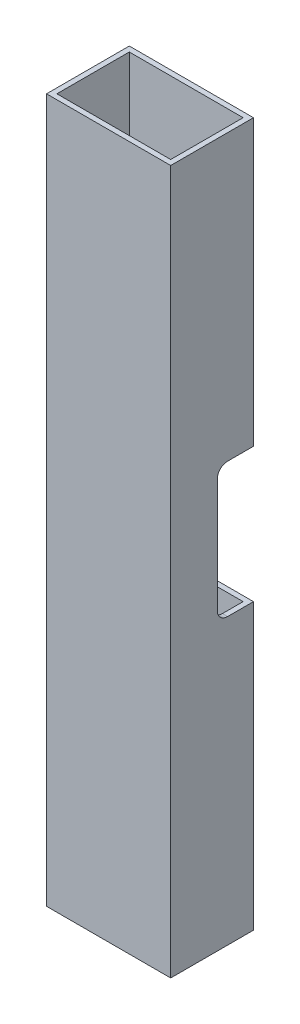
ISO-10303-21;
HEADER;
FILE_DESCRIPTION(('STEP AP214'),'2;1');
FILE_NAME('part.step','',(''),(''),'','','');
FILE_SCHEMA(('AUTOMOTIVE_DESIGN { 1 0 10303 214 1 1 1 1 }'));
ENDSEC;
DATA;
#1=APPLICATION_CONTEXT('core data for automotive mechanical design processes');
#2=APPLICATION_PROTOCOL_DEFINITION('international standard','automotive_design',2000,#1);
#3=PRODUCT_CONTEXT('',#1,'mechanical');
#4=PRODUCT('Part','Part','',(#3));
#5=PRODUCT_RELATED_PRODUCT_CATEGORY('part','',(#4));
#6=PRODUCT_DEFINITION_FORMATION('','',#4);
#7=PRODUCT_DEFINITION_CONTEXT('part definition',#1,'design');
#8=PRODUCT_DEFINITION('design','',#6,#7);
#9=PRODUCT_DEFINITION_SHAPE('','',#8);
#10=(LENGTH_UNIT() NAMED_UNIT(*) SI_UNIT(.MILLI.,.METRE.));
#11=(NAMED_UNIT(*) PLANE_ANGLE_UNIT() SI_UNIT($,.RADIAN.));
#12=(NAMED_UNIT(*) SI_UNIT($,.STERADIAN.) SOLID_ANGLE_UNIT());
#13=UNCERTAINTY_MEASURE_WITH_UNIT(LENGTH_MEASURE(1.E-05),#10,'distance_accuracy_value','');
#14=(GEOMETRIC_REPRESENTATION_CONTEXT(3) GLOBAL_UNCERTAINTY_ASSIGNED_CONTEXT((#13)) GLOBAL_UNIT_ASSIGNED_CONTEXT((#10,
#11,#12)) REPRESENTATION_CONTEXT('',''));
#15=CARTESIAN_POINT('',(0.,0.,0.));
#16=DIRECTION('',(0.,0.,1.));
#17=DIRECTION('',(1.,0.,0.));
#18=AXIS2_PLACEMENT_3D('',#15,#16,#17);
#19=CARTESIAN_POINT('',(0.,-215.9,-25.4));
#20=DIRECTION('',(0.,0.,-1.));
#21=DIRECTION('',(-1.,0.,0.));
#22=AXIS2_PLACEMENT_3D('',#19,#20,#21);
#23=PLANE('',#22);
#24=DIRECTION('',(0.,1.,0.));
#25=VECTOR('',#24,1.);
#26=CARTESIAN_POINT('',(38.1,-215.9,-25.4));
#27=LINE('',#26,#25);
#28=CARTESIAN_POINT('',(38.1,41.275,-25.4));
#29=VERTEX_POINT('',#28);
#30=CARTESIAN_POINT('',(38.1,215.9,-25.4));
#31=VERTEX_POINT('',#30);
#32=EDGE_CURVE('E213',#29,#31,#27,.T.);
#33=ORIENTED_EDGE('',*,*,#32,.F.);
#34=DIRECTION('',(-1.,0.,0.));
#35=VECTOR('',#34,1.);
#36=CARTESIAN_POINT('',(1971.59584113364,41.275,-25.3999999999995));
#37=LINE('',#36,#35);
#38=CARTESIAN_POINT('',(-38.1,41.275,-25.4));
#39=VERTEX_POINT('',#38);
#40=EDGE_CURVE('E200',#29,#39,#37,.T.);
#41=ORIENTED_EDGE('',*,*,#40,.T.);
#42=DIRECTION('',(0.,1.,0.));
#43=VECTOR('',#42,1.);
#44=CARTESIAN_POINT('',(-38.1,-215.9,-25.4));
#45=LINE('',#44,#43);
#46=CARTESIAN_POINT('',(-38.1,215.9,-25.4));
#47=VERTEX_POINT('',#46);
#48=EDGE_CURVE('E211',#39,#47,#45,.T.);
#49=ORIENTED_EDGE('',*,*,#48,.T.);
#50=DIRECTION('',(-1.,0.,0.));
#51=VECTOR('',#50,1.);
#52=CARTESIAN_POINT('',(0.,215.9,-25.4));
#53=LINE('',#52,#51);
#54=EDGE_CURVE('E325',#31,#47,#53,.T.);
#55=ORIENTED_EDGE('',*,*,#54,.F.);
#56=EDGE_LOOP('',(#33,#41,#49,#55));
#57=FACE_BOUND('',#56,.T.);
#58=ADVANCED_FACE('F14',(#57),#23,.T.);
#59=CARTESIAN_POINT('',(34.925,-215.9,0.));
#60=DIRECTION('',(1.,0.,0.));
#61=DIRECTION('',(0.,0.,-1.));
#62=AXIS2_PLACEMENT_3D('',#59,#60,#61);
#63=PLANE('',#62);
#64=DIRECTION('',(0.,0.,-1.));
#65=VECTOR('',#64,1.);
#66=CARTESIAN_POINT('',(34.925,41.275,-1.29116165991135E-13));
#67=LINE('',#66,#65);
#68=CARTESIAN_POINT('',(34.925,41.275,-9.525));
#69=VERTEX_POINT('',#68);
#70=CARTESIAN_POINT('',(34.925,41.275,-22.225));
#71=VERTEX_POINT('',#70);
#72=EDGE_CURVE('E398',#69,#71,#67,.T.);
#73=ORIENTED_EDGE('',*,*,#72,.F.);
#74=CARTESIAN_POINT('',(34.925,34.925,-9.525));
#75=DIRECTION('',(1.,0.,0.));
#76=DIRECTION('',(0.,0.,-1.));
#77=AXIS2_PLACEMENT_3D('',#74,#75,#76);
#78=CIRCLE('',#77,6.35);
#79=CARTESIAN_POINT('',(34.925,34.925,-3.175));
#80=VERTEX_POINT('',#79);
#81=EDGE_CURVE('E424',#69,#80,#78,.T.);
#82=ORIENTED_EDGE('',*,*,#81,.T.);
#83=DIRECTION('',(0.,-1.,0.));
#84=VECTOR('',#83,1.);
#85=CARTESIAN_POINT('',(34.925,-215.9,-3.17499999999996));
#86=LINE('',#85,#84);
#87=CARTESIAN_POINT('',(34.925,-34.925,-3.175));
#88=VERTEX_POINT('',#87);
#89=EDGE_CURVE('E417',#80,#88,#86,.T.);
#90=ORIENTED_EDGE('',*,*,#89,.T.);
#91=CARTESIAN_POINT('',(34.925,-34.925,-9.525));
#92=DIRECTION('',(1.,0.,0.));
#93=DIRECTION('',(0.,0.,-1.));
#94=AXIS2_PLACEMENT_3D('',#91,#92,#93);
#95=CIRCLE('',#94,6.35);
#96=CARTESIAN_POINT('',(34.925,-41.275,-9.525));
#97=VERTEX_POINT('',#96);
#98=EDGE_CURVE('E277',#88,#97,#95,.T.);
#99=ORIENTED_EDGE('',*,*,#98,.T.);
#100=DIRECTION('',(0.,0.,-1.));
#101=VECTOR('',#100,1.);
#102=CARTESIAN_POINT('',(34.925,-41.275,0.));
#103=LINE('',#102,#101);
#104=CARTESIAN_POINT('',(34.925,-41.275,-22.225));
#105=VERTEX_POINT('',#104);
#106=EDGE_CURVE('E276',#97,#105,#103,.T.);
#107=ORIENTED_EDGE('',*,*,#106,.T.);
#108=DIRECTION('',(0.,1.,0.));
#109=VECTOR('',#108,1.);
#110=CARTESIAN_POINT('',(34.925,-215.9,-22.225));
#111=LINE('',#110,#109);
#112=CARTESIAN_POINT('',(34.925,-215.9,-22.225));
#113=VERTEX_POINT('',#112);
#114=EDGE_CURVE('E274',#113,#105,#111,.T.);
#115=ORIENTED_EDGE('',*,*,#114,.F.);
#116=DIRECTION('',(0.,0.,-1.));
#117=VECTOR('',#116,1.);
#118=CARTESIAN_POINT('',(34.925,-215.9,0.));
#119=LINE('',#118,#117);
#120=CARTESIAN_POINT('',(34.925,-215.9,22.225));
#121=VERTEX_POINT('',#120);
#122=EDGE_CURVE('E307',#121,#113,#119,.T.);
#123=ORIENTED_EDGE('',*,*,#122,.F.);
#124=DIRECTION('',(0.,1.,0.));
#125=VECTOR('',#124,1.);
#126=CARTESIAN_POINT('',(34.925,-215.9,22.225));
#127=LINE('',#126,#125);
#128=CARTESIAN_POINT('',(34.925,215.9,22.225));
#129=VERTEX_POINT('',#128);
#130=EDGE_CURVE('E246',#121,#129,#127,.T.);
#131=ORIENTED_EDGE('',*,*,#130,.T.);
#132=DIRECTION('',(0.,0.,-1.));
#133=VECTOR('',#132,1.);
#134=CARTESIAN_POINT('',(34.925,215.9,0.));
#135=LINE('',#134,#133);
#136=CARTESIAN_POINT('',(34.925,215.9,-22.225));
#137=VERTEX_POINT('',#136);
#138=EDGE_CURVE('E305',#129,#137,#135,.T.);
#139=ORIENTED_EDGE('',*,*,#138,.T.);
#140=EDGE_CURVE('E284',#71,#137,#111,.T.);
#141=ORIENTED_EDGE('',*,*,#140,.F.);
#142=EDGE_LOOP('',(#73,#82,#90,#99,#107,#115,#123,#131,#139,#141));
#143=FACE_BOUND('',#142,.T.);
#144=ADVANCED_FACE('F303',(#143),#63,.F.);
#145=CARTESIAN_POINT('',(0.,-215.9,-22.225));
#146=DIRECTION('',(0.,0.,-1.));
#147=DIRECTION('',(-1.,0.,0.));
#148=AXIS2_PLACEMENT_3D('',#145,#146,#147);
#149=PLANE('',#148);
#150=DIRECTION('',(-1.,0.,0.));
#151=VECTOR('',#150,1.);
#152=CARTESIAN_POINT('',(0.,41.275,-22.225));
#153=LINE('',#152,#151);
#154=CARTESIAN_POINT('',(-34.925,41.275,-22.225));
#155=VERTEX_POINT('',#154);
#156=EDGE_CURVE('E395',#71,#155,#153,.T.);
#157=ORIENTED_EDGE('',*,*,#156,.F.);
#158=ORIENTED_EDGE('',*,*,#140,.T.);
#159=DIRECTION('',(-1.,0.,0.));
#160=VECTOR('',#159,1.);
#161=CARTESIAN_POINT('',(0.,215.9,-22.225));
#162=LINE('',#161,#160);
#163=CARTESIAN_POINT('',(-34.925,215.9,-22.225));
#164=VERTEX_POINT('',#163);
#165=EDGE_CURVE('E320',#137,#164,#162,.T.);
#166=ORIENTED_EDGE('',*,*,#165,.T.);
#167=DIRECTION('',(0.,1.,0.));
#168=VECTOR('',#167,1.);
#169=CARTESIAN_POINT('',(-34.925,-215.9,-22.225));
#170=LINE('',#169,#168);
#171=EDGE_CURVE('E285',#155,#164,#170,.T.);
#172=ORIENTED_EDGE('',*,*,#171,.F.);
#173=EDGE_LOOP('',(#157,#158,#166,#172));
#174=FACE_BOUND('',#173,.T.);
#175=ADVANCED_FACE('F482',(#174),#149,.F.);
#176=CARTESIAN_POINT('',(38.1,-215.9,0.));
#177=DIRECTION('',(1.,0.,0.));
#178=DIRECTION('',(0.,0.,-1.));
#179=AXIS2_PLACEMENT_3D('',#176,#177,#178);
#180=PLANE('',#179);
#181=CARTESIAN_POINT('',(38.1,34.925,-9.525));
#182=DIRECTION('',(1.,0.,0.));
#183=DIRECTION('',(0.,0.,-1.));
#184=AXIS2_PLACEMENT_3D('',#181,#182,#183);
#185=CIRCLE('',#184,6.35);
#186=CARTESIAN_POINT('',(38.1,41.275,-9.525));
#187=VERTEX_POINT('',#186);
#188=CARTESIAN_POINT('',(38.1,34.925,-3.175));
#189=VERTEX_POINT('',#188);
#190=EDGE_CURVE('E215',#187,#189,#185,.T.);
#191=ORIENTED_EDGE('',*,*,#190,.F.);
#192=DIRECTION('',(0.,0.,-1.));
#193=VECTOR('',#192,1.);
#194=CARTESIAN_POINT('',(38.1,41.275,-1.29116165991135E-13));
#195=LINE('',#194,#193);
#196=EDGE_CURVE('E354',#187,#29,#195,.T.);
#197=ORIENTED_EDGE('',*,*,#196,.T.);
#198=ORIENTED_EDGE('',*,*,#32,.T.);
#199=DIRECTION('',(0.,0.,-1.));
#200=VECTOR('',#199,1.);
#201=CARTESIAN_POINT('',(38.1,215.9,0.));
#202=LINE('',#201,#200);
#203=CARTESIAN_POINT('',(38.1,215.9,25.4));
#204=VERTEX_POINT('',#203);
#205=EDGE_CURVE('E370',#204,#31,#202,.T.);
#206=ORIENTED_EDGE('',*,*,#205,.F.);
#207=DIRECTION('',(0.,1.,0.));
#208=VECTOR('',#207,1.);
#209=CARTESIAN_POINT('',(38.1,-215.9,25.4));
#210=LINE('',#209,#208);
#211=CARTESIAN_POINT('',(38.1,-215.9,25.4));
#212=VERTEX_POINT('',#211);
#213=EDGE_CURVE('E238',#212,#204,#210,.T.);
#214=ORIENTED_EDGE('',*,*,#213,.F.);
#215=DIRECTION('',(0.,0.,-1.));
#216=VECTOR('',#215,1.);
#217=CARTESIAN_POINT('',(38.1,-215.9,0.));
#218=LINE('',#217,#216);
#219=CARTESIAN_POINT('',(38.1,-215.9,-25.4));
#220=VERTEX_POINT('',#219);
#221=EDGE_CURVE('E337',#212,#220,#218,.T.);
#222=ORIENTED_EDGE('',*,*,#221,.T.);
#223=CARTESIAN_POINT('',(38.1,-41.275,-25.4));
#224=VERTEX_POINT('',#223);
#225=EDGE_CURVE('E225',#220,#224,#27,.T.);
#226=ORIENTED_EDGE('',*,*,#225,.T.);
#227=DIRECTION('',(0.,0.,-1.));
#228=VECTOR('',#227,1.);
#229=CARTESIAN_POINT('',(38.1,-41.275,0.));
#230=LINE('',#229,#228);
#231=CARTESIAN_POINT('',(38.1,-41.275,-9.525));
#232=VERTEX_POINT('',#231);
#233=EDGE_CURVE('E399',#232,#224,#230,.T.);
#234=ORIENTED_EDGE('',*,*,#233,.F.);
#235=CARTESIAN_POINT('',(38.1,-34.925,-9.525));
#236=DIRECTION('',(1.,0.,0.));
#237=DIRECTION('',(0.,0.,-1.));
#238=AXIS2_PLACEMENT_3D('',#235,#236,#237);
#239=CIRCLE('',#238,6.35);
#240=CARTESIAN_POINT('',(38.1,-34.925,-3.175));
#241=VERTEX_POINT('',#240);
#242=EDGE_CURVE('E414',#241,#232,#239,.T.);
#243=ORIENTED_EDGE('',*,*,#242,.F.);
#244=DIRECTION('',(0.,-1.,0.));
#245=VECTOR('',#244,1.);
#246=CARTESIAN_POINT('',(38.1,-215.9,-3.17499999999995));
#247=LINE('',#246,#245);
#248=EDGE_CURVE('E421',#189,#241,#247,.T.);
#249=ORIENTED_EDGE('',*,*,#248,.F.);
#250=EDGE_LOOP('',(#191,#197,#198,#206,#214,#222,#226,#234,#243,#249));
#251=FACE_BOUND('',#250,.T.);
#252=ADVANCED_FACE('F16',(#251),#180,.T.);
#253=CARTESIAN_POINT('',(-34.925,-215.9,0.));
#254=DIRECTION('',(1.,0.,0.));
#255=DIRECTION('',(0.,0.,-1.));
#256=AXIS2_PLACEMENT_3D('',#253,#254,#255);
#257=PLANE('',#256);
#258=CARTESIAN_POINT('',(-34.925,34.925,-9.525));
#259=DIRECTION('',(1.,0.,0.));
#260=DIRECTION('',(0.,0.,-1.));
#261=AXIS2_PLACEMENT_3D('',#258,#259,#260);
#262=CIRCLE('',#261,6.35);
#263=CARTESIAN_POINT('',(-34.925,41.275,-9.52499999999974));
#264=VERTEX_POINT('',#263);
#265=CARTESIAN_POINT('',(-34.925,34.925,-3.175));
#266=VERTEX_POINT('',#265);
#267=EDGE_CURVE('E242',#264,#266,#262,.T.);
#268=ORIENTED_EDGE('',*,*,#267,.F.);
#269=DIRECTION('',(0.,0.,-1.));
#270=VECTOR('',#269,1.);
#271=CARTESIAN_POINT('',(-34.925,41.275,-1.29116165991135E-13));
#272=LINE('',#271,#270);
#273=EDGE_CURVE('E9',#264,#155,#272,.T.);
#274=ORIENTED_EDGE('',*,*,#273,.T.);
#275=ORIENTED_EDGE('',*,*,#171,.T.);
#276=DIRECTION('',(0.,0.,-1.));
#277=VECTOR('',#276,1.);
#278=CARTESIAN_POINT('',(-34.925,215.9,0.));
#279=LINE('',#278,#277);
#280=CARTESIAN_POINT('',(-34.925,215.9,22.225));
#281=VERTEX_POINT('',#280);
#282=EDGE_CURVE('E335',#281,#164,#279,.T.);
#283=ORIENTED_EDGE('',*,*,#282,.F.);
#284=DIRECTION('',(0.,1.,0.));
#285=VECTOR('',#284,1.);
#286=CARTESIAN_POINT('',(-34.925,-215.9,22.225));
#287=LINE('',#286,#285);
#288=CARTESIAN_POINT('',(-34.925,-215.9,22.225));
#289=VERTEX_POINT('',#288);
#290=EDGE_CURVE('E241',#289,#281,#287,.T.);
#291=ORIENTED_EDGE('',*,*,#290,.F.);
#292=DIRECTION('',(0.,0.,-1.));
#293=VECTOR('',#292,1.);
#294=CARTESIAN_POINT('',(-34.925,-215.9,0.));
#295=LINE('',#294,#293);
#296=CARTESIAN_POINT('',(-34.925,-215.9,-22.225));
#297=VERTEX_POINT('',#296);
#298=EDGE_CURVE('E282',#289,#297,#295,.T.);
#299=ORIENTED_EDGE('',*,*,#298,.T.);
#300=CARTESIAN_POINT('',(-34.925,-41.275,-22.225));
#301=VERTEX_POINT('',#300);
#302=EDGE_CURVE('E271',#297,#301,#170,.T.);
#303=ORIENTED_EDGE('',*,*,#302,.T.);
#304=DIRECTION('',(0.,0.,-1.));
#305=VECTOR('',#304,1.);
#306=CARTESIAN_POINT('',(-34.925,-41.275,0.));
#307=LINE('',#306,#305);
#308=CARTESIAN_POINT('',(-34.925,-41.275,-9.525));
#309=VERTEX_POINT('',#308);
#310=EDGE_CURVE('E23',#309,#301,#307,.T.);
#311=ORIENTED_EDGE('',*,*,#310,.F.);
#312=CARTESIAN_POINT('',(-34.925,-34.925,-9.525));
#313=DIRECTION('',(1.,0.,0.));
#314=DIRECTION('',(0.,0.,-1.));
#315=AXIS2_PLACEMENT_3D('',#312,#313,#314);
#316=CIRCLE('',#315,6.35);
#317=CARTESIAN_POINT('',(-34.925,-34.925,-3.175));
#318=VERTEX_POINT('',#317);
#319=EDGE_CURVE('E249',#318,#309,#316,.T.);
#320=ORIENTED_EDGE('',*,*,#319,.F.);
#321=DIRECTION('',(0.,-1.,0.));
#322=VECTOR('',#321,1.);
#323=CARTESIAN_POINT('',(-34.925,-215.9,-3.175));
#324=LINE('',#323,#322);
#325=EDGE_CURVE('E245',#266,#318,#324,.T.);
#326=ORIENTED_EDGE('',*,*,#325,.F.);
#327=EDGE_LOOP('',(#268,#274,#275,#283,#291,#299,#303,#311,#320,#326));
#328=FACE_BOUND('',#327,.T.);
#329=ADVANCED_FACE('F280',(#328),#257,.T.);
#330=CARTESIAN_POINT('',(0.,-215.9,22.225));
#331=DIRECTION('',(0.,0.,-1.));
#332=DIRECTION('',(-1.,0.,0.));
#333=AXIS2_PLACEMENT_3D('',#330,#331,#332);
#334=PLANE('',#333);
#335=DIRECTION('',(-1.,0.,0.));
#336=VECTOR('',#335,1.);
#337=CARTESIAN_POINT('',(0.,215.9,22.225));
#338=LINE('',#337,#336);
#339=EDGE_CURVE('E317',#129,#281,#338,.T.);
#340=ORIENTED_EDGE('',*,*,#339,.F.);
#341=ORIENTED_EDGE('',*,*,#130,.F.);
#342=DIRECTION('',(-1.,0.,0.));
#343=VECTOR('',#342,1.);
#344=CARTESIAN_POINT('',(0.,-215.9,22.225));
#345=LINE('',#344,#343);
#346=EDGE_CURVE('E363',#121,#289,#345,.T.);
#347=ORIENTED_EDGE('',*,*,#346,.T.);
#348=ORIENTED_EDGE('',*,*,#290,.T.);
#349=EDGE_LOOP('',(#340,#341,#347,#348));
#350=FACE_BOUND('',#349,.T.);
#351=ADVANCED_FACE('F323',(#350),#334,.T.);
#352=ORIENTED_EDGE('',*,*,#114,.T.);
#353=DIRECTION('',(-1.,0.,0.));
#354=VECTOR('',#353,1.);
#355=CARTESIAN_POINT('',(0.,-41.275,-22.225));
#356=LINE('',#355,#354);
#357=EDGE_CURVE('E260',#105,#301,#356,.T.);
#358=ORIENTED_EDGE('',*,*,#357,.T.);
#359=ORIENTED_EDGE('',*,*,#302,.F.);
#360=DIRECTION('',(-1.,0.,0.));
#361=VECTOR('',#360,1.);
#362=CARTESIAN_POINT('',(0.,-215.9,-22.225));
#363=LINE('',#362,#361);
#364=EDGE_CURVE('E366',#113,#297,#363,.T.);
#365=ORIENTED_EDGE('',*,*,#364,.F.);
#366=EDGE_LOOP('',(#352,#358,#359,#365));
#367=FACE_BOUND('',#366,.T.);
#368=ADVANCED_FACE('F270',(#367),#149,.F.);
#369=CARTESIAN_POINT('',(0.,-215.9,25.4));
#370=DIRECTION('',(0.,0.,-1.));
#371=DIRECTION('',(-1.,0.,0.));
#372=AXIS2_PLACEMENT_3D('',#369,#370,#371);
#373=PLANE('',#372);
#374=DIRECTION('',(-1.,0.,0.));
#375=VECTOR('',#374,1.);
#376=CARTESIAN_POINT('',(0.,215.9,25.4));
#377=LINE('',#376,#375);
#378=CARTESIAN_POINT('',(-38.1,215.9,25.4));
#379=VERTEX_POINT('',#378);
#380=EDGE_CURVE('E373',#204,#379,#377,.T.);
#381=ORIENTED_EDGE('',*,*,#380,.T.);
#382=DIRECTION('',(0.,1.,0.));
#383=VECTOR('',#382,1.);
#384=CARTESIAN_POINT('',(-38.1,-215.9,25.4));
#385=LINE('',#384,#383);
#386=CARTESIAN_POINT('',(-38.1,-215.9,25.4));
#387=VERTEX_POINT('',#386);
#388=EDGE_CURVE('E231',#387,#379,#385,.T.);
#389=ORIENTED_EDGE('',*,*,#388,.F.);
#390=DIRECTION('',(-1.,0.,0.));
#391=VECTOR('',#390,1.);
#392=CARTESIAN_POINT('',(0.,-215.9,25.4));
#393=LINE('',#392,#391);
#394=EDGE_CURVE('E342',#212,#387,#393,.T.);
#395=ORIENTED_EDGE('',*,*,#394,.F.);
#396=ORIENTED_EDGE('',*,*,#213,.T.);
#397=EDGE_LOOP('',(#381,#389,#395,#396));
#398=FACE_BOUND('',#397,.T.);
#399=ADVANCED_FACE('F385',(#398),#373,.F.);
#400=CARTESIAN_POINT('',(-38.1,-215.9,0.));
#401=DIRECTION('',(1.,0.,0.));
#402=DIRECTION('',(0.,0.,-1.));
#403=AXIS2_PLACEMENT_3D('',#400,#401,#402);
#404=PLANE('',#403);
#405=ORIENTED_EDGE('',*,*,#48,.F.);
#406=DIRECTION('',(0.,0.,1.));
#407=VECTOR('',#406,1.);
#408=CARTESIAN_POINT('',(-38.1,41.275,-16.5904098328203));
#409=LINE('',#408,#407);
#410=CARTESIAN_POINT('',(-38.1,41.275,-9.525));
#411=VERTEX_POINT('',#410);
#412=EDGE_CURVE('E196',#39,#411,#409,.T.);
#413=ORIENTED_EDGE('',*,*,#412,.T.);
#414=CARTESIAN_POINT('',(-38.1,34.925,-9.525));
#415=DIRECTION('',(-1.,0.,0.));
#416=DIRECTION('',(0.,0.,1.));
#417=AXIS2_PLACEMENT_3D('',#414,#415,#416);
#418=CIRCLE('',#417,6.35);
#419=CARTESIAN_POINT('',(-38.1,34.925,-3.175));
#420=VERTEX_POINT('',#419);
#421=EDGE_CURVE('E445',#420,#411,#418,.T.);
#422=ORIENTED_EDGE('',*,*,#421,.F.);
#423=DIRECTION('',(0.,1.,0.));
#424=VECTOR('',#423,1.);
#425=CARTESIAN_POINT('',(-38.1,-0.325113534927367,-3.175));
#426=LINE('',#425,#424);
#427=CARTESIAN_POINT('',(-38.1,-34.925,-3.175));
#428=VERTEX_POINT('',#427);
#429=EDGE_CURVE('E35',#428,#420,#426,.T.);
#430=ORIENTED_EDGE('',*,*,#429,.F.);
#431=CARTESIAN_POINT('',(-38.1,-34.925,-9.525));
#432=DIRECTION('',(-1.,0.,0.));
#433=DIRECTION('',(0.,-1.,0.));
#434=AXIS2_PLACEMENT_3D('',#431,#432,#433);
#435=CIRCLE('',#434,6.35);
#436=CARTESIAN_POINT('',(-38.1,-41.275,-9.525));
#437=VERTEX_POINT('',#436);
#438=EDGE_CURVE('E450',#437,#428,#435,.T.);
#439=ORIENTED_EDGE('',*,*,#438,.F.);
#440=DIRECTION('',(0.,0.,1.));
#441=VECTOR('',#440,1.);
#442=CARTESIAN_POINT('',(-38.1,-41.275,-16.5904098328203));
#443=LINE('',#442,#441);
#444=CARTESIAN_POINT('',(-38.1,-41.275,-25.4));
#445=VERTEX_POINT('',#444);
#446=EDGE_CURVE('E206',#445,#437,#443,.T.);
#447=ORIENTED_EDGE('',*,*,#446,.F.);
#448=CARTESIAN_POINT('',(-38.1,-215.9,-25.4));
#449=VERTEX_POINT('',#448);
#450=EDGE_CURVE('E224',#449,#445,#45,.T.);
#451=ORIENTED_EDGE('',*,*,#450,.F.);
#452=DIRECTION('',(0.,0.,-1.));
#453=VECTOR('',#452,1.);
#454=CARTESIAN_POINT('',(-38.1,-215.9,0.));
#455=LINE('',#454,#453);
#456=EDGE_CURVE('E351',#387,#449,#455,.T.);
#457=ORIENTED_EDGE('',*,*,#456,.F.);
#458=ORIENTED_EDGE('',*,*,#388,.T.);
#459=DIRECTION('',(0.,0.,-1.));
#460=VECTOR('',#459,1.);
#461=CARTESIAN_POINT('',(-38.1,215.9,0.));
#462=LINE('',#461,#460);
#463=EDGE_CURVE('E221',#379,#47,#462,.T.);
#464=ORIENTED_EDGE('',*,*,#463,.T.);
#465=EDGE_LOOP('',(#405,#413,#422,#430,#439,#447,#451,#457,#458,#464));
#466=FACE_BOUND('',#465,.T.);
#467=ADVANCED_FACE('F218',(#466),#404,.F.);
#468=DIRECTION('',(-1.,0.,0.));
#469=VECTOR('',#468,1.);
#470=CARTESIAN_POINT('',(1971.59584113364,-41.275,-25.3999999999995));
#471=LINE('',#470,#469);
#472=EDGE_CURVE('E216',#224,#445,#471,.T.);
#473=ORIENTED_EDGE('',*,*,#472,.F.);
#474=ORIENTED_EDGE('',*,*,#225,.F.);
#475=DIRECTION('',(-1.,0.,0.));
#476=VECTOR('',#475,1.);
#477=CARTESIAN_POINT('',(0.,-215.9,-25.4));
#478=LINE('',#477,#476);
#479=EDGE_CURVE('E359',#220,#449,#478,.T.);
#480=ORIENTED_EDGE('',*,*,#479,.T.);
#481=ORIENTED_EDGE('',*,*,#450,.T.);
#482=EDGE_LOOP('',(#473,#474,#480,#481));
#483=FACE_BOUND('',#482,.T.);
#484=ADVANCED_FACE('F478',(#483),#23,.T.);
#485=CARTESIAN_POINT('',(0.,-215.9,0.));
#486=DIRECTION('',(0.,-1.,0.));
#487=DIRECTION('',(1.,0.,0.));
#488=AXIS2_PLACEMENT_3D('',#485,#486,#487);
#489=PLANE('',#488);
#490=ORIENTED_EDGE('',*,*,#221,.F.);
#491=ORIENTED_EDGE('',*,*,#394,.T.);
#492=ORIENTED_EDGE('',*,*,#456,.T.);
#493=ORIENTED_EDGE('',*,*,#479,.F.);
#494=EDGE_LOOP('',(#490,#491,#492,#493));
#495=FACE_BOUND('',#494,.T.);
#496=ORIENTED_EDGE('',*,*,#346,.F.);
#497=ORIENTED_EDGE('',*,*,#122,.T.);
#498=ORIENTED_EDGE('',*,*,#364,.T.);
#499=ORIENTED_EDGE('',*,*,#298,.F.);
#500=EDGE_LOOP('',(#496,#497,#498,#499));
#501=FACE_BOUND('',#500,.T.);
#502=ADVANCED_FACE('F487',(#495,#501),#489,.T.);
#503=CARTESIAN_POINT('',(0.,215.9,0.));
#504=DIRECTION('',(0.,-1.,0.));
#505=DIRECTION('',(1.,0.,0.));
#506=AXIS2_PLACEMENT_3D('',#503,#504,#505);
#507=PLANE('',#506);
#508=ORIENTED_EDGE('',*,*,#205,.T.);
#509=ORIENTED_EDGE('',*,*,#54,.T.);
#510=ORIENTED_EDGE('',*,*,#463,.F.);
#511=ORIENTED_EDGE('',*,*,#380,.F.);
#512=EDGE_LOOP('',(#508,#509,#510,#511));
#513=FACE_BOUND('',#512,.T.);
#514=ORIENTED_EDGE('',*,*,#339,.T.);
#515=ORIENTED_EDGE('',*,*,#282,.T.);
#516=ORIENTED_EDGE('',*,*,#165,.F.);
#517=ORIENTED_EDGE('',*,*,#138,.F.);
#518=EDGE_LOOP('',(#514,#515,#516,#517));
#519=FACE_BOUND('',#518,.T.);
#520=ADVANCED_FACE('F315',(#513,#519),#507,.F.);
#521=CARTESIAN_POINT('',(1971.59584113364,41.275,-16.5904098328198));
#522=DIRECTION('',(0.,-1.,0.));
#523=DIRECTION('',(0.,0.,-1.));
#524=AXIS2_PLACEMENT_3D('',#521,#522,#523);
#525=PLANE('',#524);
#526=DIRECTION('',(-1.,0.,0.));
#527=VECTOR('',#526,1.);
#528=CARTESIAN_POINT('',(1971.59584113364,41.275,-9.52499999999946));
#529=LINE('',#528,#527);
#530=EDGE_CURVE('E442',#187,#69,#529,.T.);
#531=ORIENTED_EDGE('',*,*,#530,.T.);
#532=ORIENTED_EDGE('',*,*,#72,.T.);
#533=ORIENTED_EDGE('',*,*,#156,.T.);
#534=ORIENTED_EDGE('',*,*,#273,.F.);
#535=EDGE_CURVE('E47',#264,#411,#529,.T.);
#536=ORIENTED_EDGE('',*,*,#535,.T.);
#537=ORIENTED_EDGE('',*,*,#412,.F.);
#538=ORIENTED_EDGE('',*,*,#40,.F.);
#539=ORIENTED_EDGE('',*,*,#196,.F.);
#540=EDGE_LOOP('',(#531,#532,#533,#534,#536,#537,#538,#539));
#541=FACE_BOUND('',#540,.T.);
#542=ADVANCED_FACE('F199',(#541),#525,.T.);
#543=CARTESIAN_POINT('',(1971.59584113364,-41.275,-16.5904098328198));
#544=DIRECTION('',(0.,-1.,0.));
#545=DIRECTION('',(0.,0.,-1.));
#546=AXIS2_PLACEMENT_3D('',#543,#544,#545);
#547=PLANE('',#546);
#548=ORIENTED_EDGE('',*,*,#233,.T.);
#549=ORIENTED_EDGE('',*,*,#472,.T.);
#550=ORIENTED_EDGE('',*,*,#446,.T.);
#551=DIRECTION('',(-1.,0.,0.));
#552=VECTOR('',#551,1.);
#553=CARTESIAN_POINT('',(1971.59584113364,-41.275,-9.52499999999945));
#554=LINE('',#553,#552);
#555=EDGE_CURVE('E263',#309,#437,#554,.T.);
#556=ORIENTED_EDGE('',*,*,#555,.F.);
#557=ORIENTED_EDGE('',*,*,#310,.T.);
#558=ORIENTED_EDGE('',*,*,#357,.F.);
#559=ORIENTED_EDGE('',*,*,#106,.F.);
#560=EDGE_CURVE('E432',#232,#97,#554,.T.);
#561=ORIENTED_EDGE('',*,*,#560,.F.);
#562=EDGE_LOOP('',(#548,#549,#550,#556,#557,#558,#559,#561));
#563=FACE_BOUND('',#562,.T.);
#564=ADVANCED_FACE('F259',(#563),#547,.F.);
#565=CARTESIAN_POINT('',(1971.59584113364,-34.925,-9.52499999999946));
#566=DIRECTION('',(-1.,0.,0.));
#567=DIRECTION('',(0.,0.,1.));
#568=AXIS2_PLACEMENT_3D('',#565,#566,#567);
#569=CYLINDRICAL_SURFACE('',#568,6.35);
#570=DIRECTION('',(-1.,0.,0.));
#571=VECTOR('',#570,1.);
#572=CARTESIAN_POINT('',(1971.59584113364,-34.925,-3.17499999999945));
#573=LINE('',#572,#571);
#574=EDGE_CURVE('E435',#241,#88,#573,.T.);
#575=ORIENTED_EDGE('',*,*,#574,.F.);
#576=ORIENTED_EDGE('',*,*,#242,.T.);
#577=ORIENTED_EDGE('',*,*,#560,.T.);
#578=ORIENTED_EDGE('',*,*,#98,.F.);
#579=EDGE_LOOP('',(#575,#576,#577,#578));
#580=FACE_BOUND('',#579,.T.);
#581=ADVANCED_FACE('F554',(#580),#569,.F.);
#582=CARTESIAN_POINT('',(1971.59584113364,-0.325113534927367,-3.17499999999945));
#583=DIRECTION('',(0.,0.,1.));
#584=DIRECTION('',(1.,0.,0.));
#585=AXIS2_PLACEMENT_3D('',#582,#583,#584);
#586=PLANE('',#585);
#587=DIRECTION('',(-1.,0.,0.));
#588=VECTOR('',#587,1.);
#589=CARTESIAN_POINT('',(1971.59584113364,34.925,-3.17499999999946));
#590=LINE('',#589,#588);
#591=EDGE_CURVE('E438',#189,#80,#590,.T.);
#592=ORIENTED_EDGE('',*,*,#591,.F.);
#593=ORIENTED_EDGE('',*,*,#248,.T.);
#594=ORIENTED_EDGE('',*,*,#574,.T.);
#595=ORIENTED_EDGE('',*,*,#89,.F.);
#596=EDGE_LOOP('',(#592,#593,#594,#595));
#597=FACE_BOUND('',#596,.T.);
#598=ADVANCED_FACE('F473',(#597),#586,.F.);
#599=CARTESIAN_POINT('',(1971.59584113364,34.925,-9.52499999999946));
#600=DIRECTION('',(-1.,0.,0.));
#601=DIRECTION('',(0.,0.,1.));
#602=AXIS2_PLACEMENT_3D('',#599,#600,#601);
#603=CYLINDRICAL_SURFACE('',#602,6.35);
#604=ORIENTED_EDGE('',*,*,#530,.F.);
#605=ORIENTED_EDGE('',*,*,#190,.T.);
#606=ORIENTED_EDGE('',*,*,#591,.T.);
#607=ORIENTED_EDGE('',*,*,#81,.F.);
#608=EDGE_LOOP('',(#604,#605,#606,#607));
#609=FACE_BOUND('',#608,.T.);
#610=ADVANCED_FACE('F467',(#609),#603,.F.);
#611=ORIENTED_EDGE('',*,*,#319,.T.);
#612=ORIENTED_EDGE('',*,*,#555,.T.);
#613=ORIENTED_EDGE('',*,*,#438,.T.);
#614=EDGE_CURVE('E436',#318,#428,#573,.T.);
#615=ORIENTED_EDGE('',*,*,#614,.F.);
#616=EDGE_LOOP('',(#611,#612,#613,#615));
#617=FACE_BOUND('',#616,.T.);
#618=ADVANCED_FACE('F461',(#617),#569,.F.);
#619=ORIENTED_EDGE('',*,*,#325,.T.);
#620=ORIENTED_EDGE('',*,*,#614,.T.);
#621=ORIENTED_EDGE('',*,*,#429,.T.);
#622=EDGE_CURVE('E439',#266,#420,#590,.T.);
#623=ORIENTED_EDGE('',*,*,#622,.F.);
#624=EDGE_LOOP('',(#619,#620,#621,#623));
#625=FACE_BOUND('',#624,.T.);
#626=ADVANCED_FACE('F463',(#625),#586,.F.);
#627=ORIENTED_EDGE('',*,*,#267,.T.);
#628=ORIENTED_EDGE('',*,*,#622,.T.);
#629=ORIENTED_EDGE('',*,*,#421,.T.);
#630=ORIENTED_EDGE('',*,*,#535,.F.);
#631=EDGE_LOOP('',(#627,#628,#629,#630));
#632=FACE_BOUND('',#631,.T.);
#633=ADVANCED_FACE('F464',(#632),#603,.F.);
#634=CLOSED_SHELL('',(#58,#144,#175,#252,#329,#351,#368,#399,#467,#484,#502,#520,#542,#564,#581,
#598,#610,#618,#626,#633));
#635=MANIFOLD_SOLID_BREP('B1',#634);
#636=ADVANCED_BREP_SHAPE_REPRESENTATION('',(#18,#635),#14);
#637=SHAPE_DEFINITION_REPRESENTATION(#9,#636);
ENDSEC;
END-ISO-10303-21;
